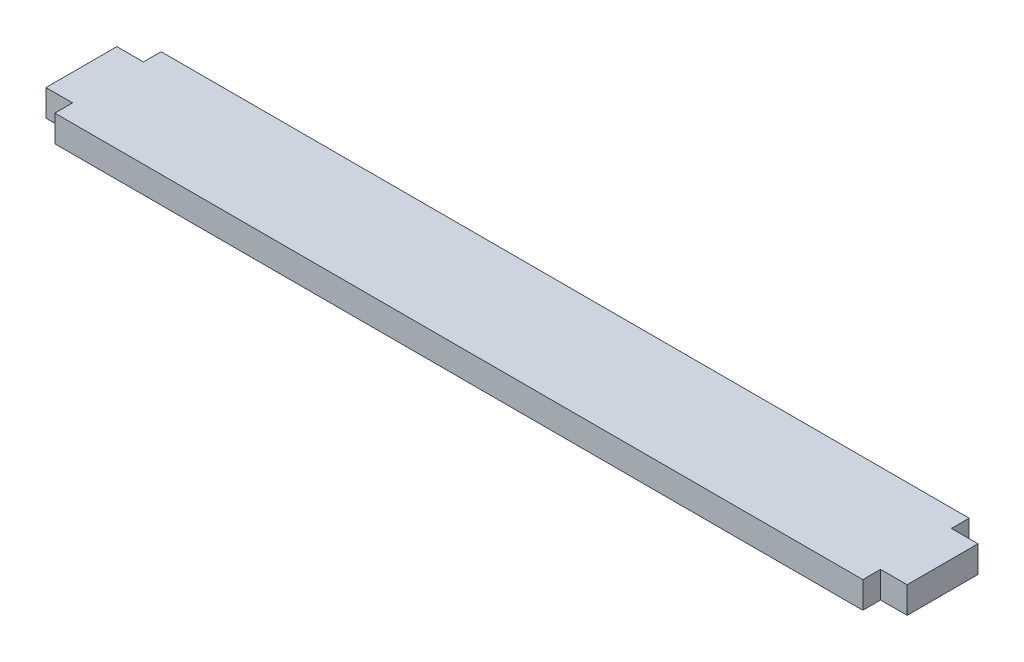
ISO-10303-21;
HEADER;
FILE_DESCRIPTION(('STEP AP214'),'2;1');
FILE_NAME('part.step','',(''),(''),'','','');
FILE_SCHEMA(('AUTOMOTIVE_DESIGN { 1 0 10303 214 1 1 1 1 }'));
ENDSEC;
DATA;
#1=APPLICATION_CONTEXT('core data for automotive mechanical design processes');
#2=APPLICATION_PROTOCOL_DEFINITION('international standard','automotive_design',2000,#1);
#3=PRODUCT_CONTEXT('',#1,'mechanical');
#4=PRODUCT('Part','Part','',(#3));
#5=PRODUCT_RELATED_PRODUCT_CATEGORY('part','',(#4));
#6=PRODUCT_DEFINITION_FORMATION('','',#4);
#7=PRODUCT_DEFINITION_CONTEXT('part definition',#1,'design');
#8=PRODUCT_DEFINITION('design','',#6,#7);
#9=PRODUCT_DEFINITION_SHAPE('','',#8);
#10=(LENGTH_UNIT() NAMED_UNIT(*) SI_UNIT(.MILLI.,.METRE.));
#11=(NAMED_UNIT(*) PLANE_ANGLE_UNIT() SI_UNIT($,.RADIAN.));
#12=(NAMED_UNIT(*) SI_UNIT($,.STERADIAN.) SOLID_ANGLE_UNIT());
#13=UNCERTAINTY_MEASURE_WITH_UNIT(LENGTH_MEASURE(1.E-05),#10,'distance_accuracy_value','');
#14=(GEOMETRIC_REPRESENTATION_CONTEXT(3) GLOBAL_UNCERTAINTY_ASSIGNED_CONTEXT((#13)) GLOBAL_UNIT_ASSIGNED_CONTEXT((#10,
#11,#12)) REPRESENTATION_CONTEXT('',''));
#15=CARTESIAN_POINT('',(0.,0.,0.));
#16=DIRECTION('',(0.,0.,1.));
#17=DIRECTION('',(1.,0.,0.));
#18=AXIS2_PLACEMENT_3D('',#15,#16,#17);
#19=CARTESIAN_POINT('',(45.6,3.,-6.));
#20=DIRECTION('',(-1.,0.,0.));
#21=DIRECTION('',(0.,0.,1.));
#22=AXIS2_PLACEMENT_3D('',#19,#20,#21);
#23=PLANE('',#22);
#24=DIRECTION('',(0.,0.,-1.));
#25=VECTOR('',#24,1.);
#26=CARTESIAN_POINT('',(45.6,0.,-6.));
#27=LINE('',#26,#25);
#28=CARTESIAN_POINT('',(45.6,0.,-4.));
#29=VERTEX_POINT('',#28);
#30=CARTESIAN_POINT('',(45.6,0.,-6.));
#31=VERTEX_POINT('',#30);
#32=EDGE_CURVE('E152',#29,#31,#27,.T.);
#33=ORIENTED_EDGE('',*,*,#32,.T.);
#34=DIRECTION('',(0.,-1.,0.));
#35=VECTOR('',#34,1.);
#36=CARTESIAN_POINT('',(45.6,3.,-6.));
#37=LINE('',#36,#35);
#38=CARTESIAN_POINT('',(45.6,3.,-6.));
#39=VERTEX_POINT('',#38);
#40=EDGE_CURVE('E11',#39,#31,#37,.T.);
#41=ORIENTED_EDGE('',*,*,#40,.F.);
#42=DIRECTION('',(0.,0.,-1.));
#43=VECTOR('',#42,1.);
#44=CARTESIAN_POINT('',(45.6,3.,-6.));
#45=LINE('',#44,#43);
#46=CARTESIAN_POINT('',(45.6,3.,-4.));
#47=VERTEX_POINT('',#46);
#48=EDGE_CURVE('E174',#47,#39,#45,.T.);
#49=ORIENTED_EDGE('',*,*,#48,.F.);
#50=DIRECTION('',(0.,-1.,0.));
#51=VECTOR('',#50,1.);
#52=CARTESIAN_POINT('',(45.6,3.,-4.));
#53=LINE('',#52,#51);
#54=EDGE_CURVE('E148',#47,#29,#53,.T.);
#55=ORIENTED_EDGE('',*,*,#54,.T.);
#56=EDGE_LOOP('',(#33,#41,#49,#55));
#57=FACE_BOUND('',#56,.T.);
#58=ADVANCED_FACE('F32',(#57),#23,.F.);
#59=CARTESIAN_POINT('',(-45.6,3.,-6.));
#60=DIRECTION('',(0.,0.,1.));
#61=DIRECTION('',(1.,0.,0.));
#62=AXIS2_PLACEMENT_3D('',#59,#60,#61);
#63=PLANE('',#62);
#64=DIRECTION('',(-1.,0.,0.));
#65=VECTOR('',#64,1.);
#66=CARTESIAN_POINT('',(-45.6,0.,-6.));
#67=LINE('',#66,#65);
#68=CARTESIAN_POINT('',(-45.6,0.,-6.));
#69=VERTEX_POINT('',#68);
#70=EDGE_CURVE('E155',#31,#69,#67,.T.);
#71=ORIENTED_EDGE('',*,*,#70,.T.);
#72=DIRECTION('',(0.,-1.,0.));
#73=VECTOR('',#72,1.);
#74=CARTESIAN_POINT('',(-45.6,3.,-6.));
#75=LINE('',#74,#73);
#76=CARTESIAN_POINT('',(-45.6,3.,-6.));
#77=VERTEX_POINT('',#76);
#78=EDGE_CURVE('E40',#77,#69,#75,.T.);
#79=ORIENTED_EDGE('',*,*,#78,.F.);
#80=DIRECTION('',(-1.,0.,0.));
#81=VECTOR('',#80,1.);
#82=CARTESIAN_POINT('',(-45.6,3.,-6.));
#83=LINE('',#82,#81);
#84=EDGE_CURVE('E103',#39,#77,#83,.T.);
#85=ORIENTED_EDGE('',*,*,#84,.F.);
#86=ORIENTED_EDGE('',*,*,#40,.T.);
#87=EDGE_LOOP('',(#71,#79,#85,#86));
#88=FACE_BOUND('',#87,.T.);
#89=ADVANCED_FACE('F252',(#88),#63,.F.);
#90=CARTESIAN_POINT('',(-45.6,3.,-6.));
#91=DIRECTION('',(1.,0.,0.));
#92=DIRECTION('',(0.,0.,-1.));
#93=AXIS2_PLACEMENT_3D('',#90,#91,#92);
#94=PLANE('',#93);
#95=DIRECTION('',(0.,0.,1.));
#96=VECTOR('',#95,1.);
#97=CARTESIAN_POINT('',(-45.6,0.,-6.));
#98=LINE('',#97,#96);
#99=CARTESIAN_POINT('',(-45.6,0.,-4.));
#100=VERTEX_POINT('',#99);
#101=EDGE_CURVE('E157',#69,#100,#98,.T.);
#102=ORIENTED_EDGE('',*,*,#101,.T.);
#103=DIRECTION('',(0.,-1.,0.));
#104=VECTOR('',#103,1.);
#105=CARTESIAN_POINT('',(-45.6,3.,-4.));
#106=LINE('',#105,#104);
#107=CARTESIAN_POINT('',(-45.6,3.,-4.));
#108=VERTEX_POINT('',#107);
#109=EDGE_CURVE('E193',#108,#100,#106,.T.);
#110=ORIENTED_EDGE('',*,*,#109,.F.);
#111=DIRECTION('',(0.,0.,1.));
#112=VECTOR('',#111,1.);
#113=CARTESIAN_POINT('',(-45.6,3.,-6.));
#114=LINE('',#113,#112);
#115=EDGE_CURVE('E201',#77,#108,#114,.T.);
#116=ORIENTED_EDGE('',*,*,#115,.F.);
#117=ORIENTED_EDGE('',*,*,#78,.T.);
#118=EDGE_LOOP('',(#102,#110,#116,#117));
#119=FACE_BOUND('',#118,.T.);
#120=ADVANCED_FACE('F199',(#119),#94,.F.);
#121=CARTESIAN_POINT('',(-45.6,3.,-4.));
#122=DIRECTION('',(0.,0.,1.));
#123=DIRECTION('',(1.,0.,0.));
#124=AXIS2_PLACEMENT_3D('',#121,#122,#123);
#125=PLANE('',#124);
#126=DIRECTION('',(-1.,0.,0.));
#127=VECTOR('',#126,1.);
#128=CARTESIAN_POINT('',(-45.6,0.,-4.));
#129=LINE('',#128,#127);
#130=CARTESIAN_POINT('',(-48.6,0.,-4.));
#131=VERTEX_POINT('',#130);
#132=EDGE_CURVE('E159',#100,#131,#129,.T.);
#133=ORIENTED_EDGE('',*,*,#132,.T.);
#134=DIRECTION('',(0.,-1.,0.));
#135=VECTOR('',#134,1.);
#136=CARTESIAN_POINT('',(-48.6,3.,-4.));
#137=LINE('',#136,#135);
#138=CARTESIAN_POINT('',(-48.6,3.,-4.));
#139=VERTEX_POINT('',#138);
#140=EDGE_CURVE('E190',#139,#131,#137,.T.);
#141=ORIENTED_EDGE('',*,*,#140,.F.);
#142=DIRECTION('',(-1.,0.,0.));
#143=VECTOR('',#142,1.);
#144=CARTESIAN_POINT('',(-45.6,3.,-4.));
#145=LINE('',#144,#143);
#146=EDGE_CURVE('E219',#108,#139,#145,.T.);
#147=ORIENTED_EDGE('',*,*,#146,.F.);
#148=ORIENTED_EDGE('',*,*,#109,.T.);
#149=EDGE_LOOP('',(#133,#141,#147,#148));
#150=FACE_BOUND('',#149,.T.);
#151=ADVANCED_FACE('F210',(#150),#125,.F.);
#152=CARTESIAN_POINT('',(-48.6,3.,-4.));
#153=DIRECTION('',(1.,0.,0.));
#154=DIRECTION('',(0.,0.,-1.));
#155=AXIS2_PLACEMENT_3D('',#152,#153,#154);
#156=PLANE('',#155);
#157=DIRECTION('',(0.,0.,1.));
#158=VECTOR('',#157,1.);
#159=CARTESIAN_POINT('',(-48.6,0.,-4.));
#160=LINE('',#159,#158);
#161=CARTESIAN_POINT('',(-48.6,0.,4.));
#162=VERTEX_POINT('',#161);
#163=EDGE_CURVE('E161',#131,#162,#160,.T.);
#164=ORIENTED_EDGE('',*,*,#163,.T.);
#165=DIRECTION('',(0.,-1.,0.));
#166=VECTOR('',#165,1.);
#167=CARTESIAN_POINT('',(-48.6,3.,4.));
#168=LINE('',#167,#166);
#169=CARTESIAN_POINT('',(-48.6,3.,4.));
#170=VERTEX_POINT('',#169);
#171=EDGE_CURVE('E187',#170,#162,#168,.T.);
#172=ORIENTED_EDGE('',*,*,#171,.F.);
#173=DIRECTION('',(0.,0.,1.));
#174=VECTOR('',#173,1.);
#175=CARTESIAN_POINT('',(-48.6,3.,-4.));
#176=LINE('',#175,#174);
#177=EDGE_CURVE('E216',#139,#170,#176,.T.);
#178=ORIENTED_EDGE('',*,*,#177,.F.);
#179=ORIENTED_EDGE('',*,*,#140,.T.);
#180=EDGE_LOOP('',(#164,#172,#178,#179));
#181=FACE_BOUND('',#180,.T.);
#182=ADVANCED_FACE('F214',(#181),#156,.F.);
#183=CARTESIAN_POINT('',(-48.6,3.,4.));
#184=DIRECTION('',(0.,0.,-1.));
#185=DIRECTION('',(-1.,0.,0.));
#186=AXIS2_PLACEMENT_3D('',#183,#184,#185);
#187=PLANE('',#186);
#188=DIRECTION('',(1.,0.,0.));
#189=VECTOR('',#188,1.);
#190=CARTESIAN_POINT('',(-48.6,0.,4.));
#191=LINE('',#190,#189);
#192=CARTESIAN_POINT('',(-45.6,0.,4.));
#193=VERTEX_POINT('',#192);
#194=EDGE_CURVE('E163',#162,#193,#191,.T.);
#195=ORIENTED_EDGE('',*,*,#194,.T.);
#196=DIRECTION('',(0.,-1.,0.));
#197=VECTOR('',#196,1.);
#198=CARTESIAN_POINT('',(-45.6,3.,4.));
#199=LINE('',#198,#197);
#200=CARTESIAN_POINT('',(-45.6,3.,4.));
#201=VERTEX_POINT('',#200);
#202=EDGE_CURVE('E184',#201,#193,#199,.T.);
#203=ORIENTED_EDGE('',*,*,#202,.F.);
#204=DIRECTION('',(1.,0.,0.));
#205=VECTOR('',#204,1.);
#206=CARTESIAN_POINT('',(-48.6,3.,4.));
#207=LINE('',#206,#205);
#208=EDGE_CURVE('E218',#170,#201,#207,.T.);
#209=ORIENTED_EDGE('',*,*,#208,.F.);
#210=ORIENTED_EDGE('',*,*,#171,.T.);
#211=EDGE_LOOP('',(#195,#203,#209,#210));
#212=FACE_BOUND('',#211,.T.);
#213=ADVANCED_FACE('F265',(#212),#187,.F.);
#214=CARTESIAN_POINT('',(-45.6,3.,4.));
#215=DIRECTION('',(1.,0.,0.));
#216=DIRECTION('',(0.,0.,-1.));
#217=AXIS2_PLACEMENT_3D('',#214,#215,#216);
#218=PLANE('',#217);
#219=DIRECTION('',(0.,0.,1.));
#220=VECTOR('',#219,1.);
#221=CARTESIAN_POINT('',(-45.6,0.,4.));
#222=LINE('',#221,#220);
#223=CARTESIAN_POINT('',(-45.6,0.,6.));
#224=VERTEX_POINT('',#223);
#225=EDGE_CURVE('E165',#193,#224,#222,.T.);
#226=ORIENTED_EDGE('',*,*,#225,.T.);
#227=DIRECTION('',(0.,-1.,0.));
#228=VECTOR('',#227,1.);
#229=CARTESIAN_POINT('',(-45.6,3.,6.));
#230=LINE('',#229,#228);
#231=CARTESIAN_POINT('',(-45.6,3.,6.));
#232=VERTEX_POINT('',#231);
#233=EDGE_CURVE('E181',#232,#224,#230,.T.);
#234=ORIENTED_EDGE('',*,*,#233,.F.);
#235=DIRECTION('',(0.,0.,1.));
#236=VECTOR('',#235,1.);
#237=CARTESIAN_POINT('',(-45.6,3.,4.));
#238=LINE('',#237,#236);
#239=EDGE_CURVE('E221',#201,#232,#238,.T.);
#240=ORIENTED_EDGE('',*,*,#239,.F.);
#241=ORIENTED_EDGE('',*,*,#202,.T.);
#242=EDGE_LOOP('',(#226,#234,#240,#241));
#243=FACE_BOUND('',#242,.T.);
#244=ADVANCED_FACE('F268',(#243),#218,.F.);
#245=CARTESIAN_POINT('',(-45.6,3.,6.));
#246=DIRECTION('',(0.,0.,-1.));
#247=DIRECTION('',(-1.,0.,0.));
#248=AXIS2_PLACEMENT_3D('',#245,#246,#247);
#249=PLANE('',#248);
#250=DIRECTION('',(1.,0.,0.));
#251=VECTOR('',#250,1.);
#252=CARTESIAN_POINT('',(-45.6,0.,6.));
#253=LINE('',#252,#251);
#254=CARTESIAN_POINT('',(45.6,0.,6.));
#255=VERTEX_POINT('',#254);
#256=EDGE_CURVE('E167',#224,#255,#253,.T.);
#257=ORIENTED_EDGE('',*,*,#256,.T.);
#258=DIRECTION('',(0.,-1.,0.));
#259=VECTOR('',#258,1.);
#260=CARTESIAN_POINT('',(45.6,3.,6.));
#261=LINE('',#260,#259);
#262=CARTESIAN_POINT('',(45.6,3.,6.));
#263=VERTEX_POINT('',#262);
#264=EDGE_CURVE('E178',#263,#255,#261,.T.);
#265=ORIENTED_EDGE('',*,*,#264,.F.);
#266=DIRECTION('',(1.,0.,0.));
#267=VECTOR('',#266,1.);
#268=CARTESIAN_POINT('',(-45.6,3.,6.));
#269=LINE('',#268,#267);
#270=EDGE_CURVE('E227',#232,#263,#269,.T.);
#271=ORIENTED_EDGE('',*,*,#270,.F.);
#272=ORIENTED_EDGE('',*,*,#233,.T.);
#273=EDGE_LOOP('',(#257,#265,#271,#272));
#274=FACE_BOUND('',#273,.T.);
#275=ADVANCED_FACE('F233',(#274),#249,.F.);
#276=CARTESIAN_POINT('',(45.6,3.,4.));
#277=DIRECTION('',(-1.,0.,0.));
#278=DIRECTION('',(0.,0.,1.));
#279=AXIS2_PLACEMENT_3D('',#276,#277,#278);
#280=PLANE('',#279);
#281=DIRECTION('',(0.,0.,-1.));
#282=VECTOR('',#281,1.);
#283=CARTESIAN_POINT('',(45.6,0.,4.));
#284=LINE('',#283,#282);
#285=CARTESIAN_POINT('',(45.6,0.,4.));
#286=VERTEX_POINT('',#285);
#287=EDGE_CURVE('E169',#255,#286,#284,.T.);
#288=ORIENTED_EDGE('',*,*,#287,.T.);
#289=DIRECTION('',(0.,-1.,0.));
#290=VECTOR('',#289,1.);
#291=CARTESIAN_POINT('',(45.6,3.,4.));
#292=LINE('',#291,#290);
#293=CARTESIAN_POINT('',(45.6,3.,4.));
#294=VERTEX_POINT('',#293);
#295=EDGE_CURVE('E143',#294,#286,#292,.T.);
#296=ORIENTED_EDGE('',*,*,#295,.F.);
#297=DIRECTION('',(0.,0.,-1.));
#298=VECTOR('',#297,1.);
#299=CARTESIAN_POINT('',(45.6,3.,4.));
#300=LINE('',#299,#298);
#301=EDGE_CURVE('E134',#263,#294,#300,.T.);
#302=ORIENTED_EDGE('',*,*,#301,.F.);
#303=ORIENTED_EDGE('',*,*,#264,.T.);
#304=EDGE_LOOP('',(#288,#296,#302,#303));
#305=FACE_BOUND('',#304,.T.);
#306=ADVANCED_FACE('F237',(#305),#280,.F.);
#307=CARTESIAN_POINT('',(48.6,3.,4.));
#308=DIRECTION('',(0.,0.,-1.));
#309=DIRECTION('',(-1.,0.,0.));
#310=AXIS2_PLACEMENT_3D('',#307,#308,#309);
#311=PLANE('',#310);
#312=DIRECTION('',(1.,0.,0.));
#313=VECTOR('',#312,1.);
#314=CARTESIAN_POINT('',(48.6,0.,4.));
#315=LINE('',#314,#313);
#316=CARTESIAN_POINT('',(48.6,0.,4.));
#317=VERTEX_POINT('',#316);
#318=EDGE_CURVE('E142',#286,#317,#315,.T.);
#319=ORIENTED_EDGE('',*,*,#318,.T.);
#320=DIRECTION('',(0.,-1.,0.));
#321=VECTOR('',#320,1.);
#322=CARTESIAN_POINT('',(48.6,3.,4.));
#323=LINE('',#322,#321);
#324=CARTESIAN_POINT('',(48.6,3.,4.));
#325=VERTEX_POINT('',#324);
#326=EDGE_CURVE('E139',#325,#317,#323,.T.);
#327=ORIENTED_EDGE('',*,*,#326,.F.);
#328=DIRECTION('',(1.,0.,0.));
#329=VECTOR('',#328,1.);
#330=CARTESIAN_POINT('',(48.6,3.,4.));
#331=LINE('',#330,#329);
#332=EDGE_CURVE('E128',#294,#325,#331,.T.);
#333=ORIENTED_EDGE('',*,*,#332,.F.);
#334=ORIENTED_EDGE('',*,*,#295,.T.);
#335=EDGE_LOOP('',(#319,#327,#333,#334));
#336=FACE_BOUND('',#335,.T.);
#337=ADVANCED_FACE('F140',(#336),#311,.F.);
#338=CARTESIAN_POINT('',(48.6,3.,-4.));
#339=DIRECTION('',(-1.,0.,0.));
#340=DIRECTION('',(0.,0.,1.));
#341=AXIS2_PLACEMENT_3D('',#338,#339,#340);
#342=PLANE('',#341);
#343=DIRECTION('',(0.,0.,-1.));
#344=VECTOR('',#343,1.);
#345=CARTESIAN_POINT('',(48.6,0.,-4.));
#346=LINE('',#345,#344);
#347=CARTESIAN_POINT('',(48.6,0.,-4.));
#348=VERTEX_POINT('',#347);
#349=EDGE_CURVE('E89',#317,#348,#346,.T.);
#350=ORIENTED_EDGE('',*,*,#349,.T.);
#351=DIRECTION('',(0.,-1.,0.));
#352=VECTOR('',#351,1.);
#353=CARTESIAN_POINT('',(48.6,3.,-4.));
#354=LINE('',#353,#352);
#355=CARTESIAN_POINT('',(48.6,3.,-4.));
#356=VERTEX_POINT('',#355);
#357=EDGE_CURVE('E144',#356,#348,#354,.T.);
#358=ORIENTED_EDGE('',*,*,#357,.F.);
#359=DIRECTION('',(0.,0.,-1.));
#360=VECTOR('',#359,1.);
#361=CARTESIAN_POINT('',(48.6,3.,-4.));
#362=LINE('',#361,#360);
#363=EDGE_CURVE('E132',#325,#356,#362,.T.);
#364=ORIENTED_EDGE('',*,*,#363,.F.);
#365=ORIENTED_EDGE('',*,*,#326,.T.);
#366=EDGE_LOOP('',(#350,#358,#364,#365));
#367=FACE_BOUND('',#366,.T.);
#368=ADVANCED_FACE('F146',(#367),#342,.F.);
#369=CARTESIAN_POINT('',(45.6,3.,-4.));
#370=DIRECTION('',(0.,0.,1.));
#371=DIRECTION('',(1.,0.,0.));
#372=AXIS2_PLACEMENT_3D('',#369,#370,#371);
#373=PLANE('',#372);
#374=DIRECTION('',(-1.,0.,0.));
#375=VECTOR('',#374,1.);
#376=CARTESIAN_POINT('',(45.6,0.,-4.));
#377=LINE('',#376,#375);
#378=EDGE_CURVE('E95',#348,#29,#377,.T.);
#379=ORIENTED_EDGE('',*,*,#378,.T.);
#380=ORIENTED_EDGE('',*,*,#54,.F.);
#381=DIRECTION('',(-1.,0.,0.));
#382=VECTOR('',#381,1.);
#383=CARTESIAN_POINT('',(45.6,3.,-4.));
#384=LINE('',#383,#382);
#385=EDGE_CURVE('E48',#356,#47,#384,.T.);
#386=ORIENTED_EDGE('',*,*,#385,.F.);
#387=ORIENTED_EDGE('',*,*,#357,.T.);
#388=EDGE_LOOP('',(#379,#380,#386,#387));
#389=FACE_BOUND('',#388,.T.);
#390=ADVANCED_FACE('F241',(#389),#373,.F.);
#391=CARTESIAN_POINT('',(0.,3.,0.));
#392=DIRECTION('',(0.,1.,0.));
#393=DIRECTION('',(0.,0.,1.));
#394=AXIS2_PLACEMENT_3D('',#391,#392,#393);
#395=PLANE('',#394);
#396=ORIENTED_EDGE('',*,*,#48,.T.);
#397=ORIENTED_EDGE('',*,*,#84,.T.);
#398=ORIENTED_EDGE('',*,*,#115,.T.);
#399=ORIENTED_EDGE('',*,*,#146,.T.);
#400=ORIENTED_EDGE('',*,*,#177,.T.);
#401=ORIENTED_EDGE('',*,*,#208,.T.);
#402=ORIENTED_EDGE('',*,*,#239,.T.);
#403=ORIENTED_EDGE('',*,*,#270,.T.);
#404=ORIENTED_EDGE('',*,*,#301,.T.);
#405=ORIENTED_EDGE('',*,*,#332,.T.);
#406=ORIENTED_EDGE('',*,*,#363,.T.);
#407=ORIENTED_EDGE('',*,*,#385,.T.);
#408=EDGE_LOOP('',(#396,#397,#398,#399,#400,#401,#402,#403,#404,#405,#406,#407));
#409=FACE_BOUND('',#408,.T.);
#410=ADVANCED_FACE('F130',(#409),#395,.T.);
#411=CARTESIAN_POINT('',(0.,0.,0.));
#412=DIRECTION('',(0.,1.,0.));
#413=DIRECTION('',(0.,0.,1.));
#414=AXIS2_PLACEMENT_3D('',#411,#412,#413);
#415=PLANE('',#414);
#416=ORIENTED_EDGE('',*,*,#32,.F.);
#417=ORIENTED_EDGE('',*,*,#378,.F.);
#418=ORIENTED_EDGE('',*,*,#349,.F.);
#419=ORIENTED_EDGE('',*,*,#318,.F.);
#420=ORIENTED_EDGE('',*,*,#287,.F.);
#421=ORIENTED_EDGE('',*,*,#256,.F.);
#422=ORIENTED_EDGE('',*,*,#225,.F.);
#423=ORIENTED_EDGE('',*,*,#194,.F.);
#424=ORIENTED_EDGE('',*,*,#163,.F.);
#425=ORIENTED_EDGE('',*,*,#132,.F.);
#426=ORIENTED_EDGE('',*,*,#101,.F.);
#427=ORIENTED_EDGE('',*,*,#70,.F.);
#428=EDGE_LOOP('',(#416,#417,#418,#419,#420,#421,#422,#423,#424,#425,#426,#427));
#429=FACE_BOUND('',#428,.T.);
#430=ADVANCED_FACE('F205',(#429),#415,.F.);
#431=CLOSED_SHELL('',(#58,#89,#120,#151,#182,#213,#244,#275,#306,#337,#368,#390,#410,#430));
#432=MANIFOLD_SOLID_BREP('B2',#431);
#433=ADVANCED_BREP_SHAPE_REPRESENTATION('',(#18,#432),#14);
#434=SHAPE_DEFINITION_REPRESENTATION(#9,#433);
ENDSEC;
END-ISO-10303-21;
